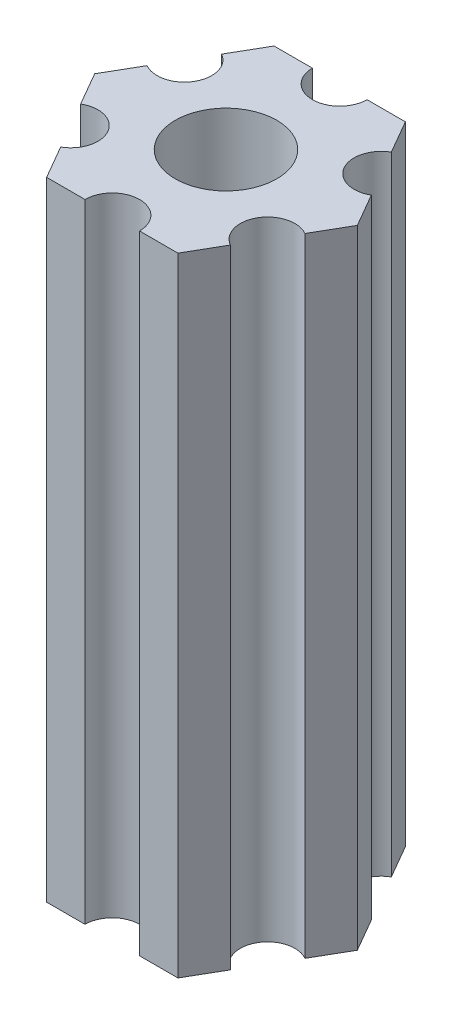
ISO-10303-21;
HEADER;
FILE_DESCRIPTION(('STEP AP214'),'2;1');
FILE_NAME('part.step','',(''),(''),'','','');
FILE_SCHEMA(('AUTOMOTIVE_DESIGN { 1 0 10303 214 1 1 1 1 }'));
ENDSEC;
DATA;
#1=APPLICATION_CONTEXT('core data for automotive mechanical design processes');
#2=APPLICATION_PROTOCOL_DEFINITION('international standard','automotive_design',2000,#1);
#3=PRODUCT_CONTEXT('',#1,'mechanical');
#4=PRODUCT('Part','Part','',(#3));
#5=PRODUCT_RELATED_PRODUCT_CATEGORY('part','',(#4));
#6=PRODUCT_DEFINITION_FORMATION('','',#4);
#7=PRODUCT_DEFINITION_CONTEXT('part definition',#1,'design');
#8=PRODUCT_DEFINITION('design','',#6,#7);
#9=PRODUCT_DEFINITION_SHAPE('','',#8);
#10=(LENGTH_UNIT() NAMED_UNIT(*) SI_UNIT(.MILLI.,.METRE.));
#11=(NAMED_UNIT(*) PLANE_ANGLE_UNIT() SI_UNIT($,.RADIAN.));
#12=(NAMED_UNIT(*) SI_UNIT($,.STERADIAN.) SOLID_ANGLE_UNIT());
#13=UNCERTAINTY_MEASURE_WITH_UNIT(LENGTH_MEASURE(1.E-05),#10,'distance_accuracy_value','');
#14=(GEOMETRIC_REPRESENTATION_CONTEXT(3) GLOBAL_UNCERTAINTY_ASSIGNED_CONTEXT((#13)) GLOBAL_UNIT_ASSIGNED_CONTEXT((#10,
#11,#12)) REPRESENTATION_CONTEXT('',''));
#15=CARTESIAN_POINT('',(0.,0.,0.));
#16=DIRECTION('',(0.,0.,1.));
#17=DIRECTION('',(1.,0.,0.));
#18=AXIS2_PLACEMENT_3D('',#15,#16,#17);
#19=CARTESIAN_POINT('',(77.5897685692615,-34.5,18.0870190528384));
#20=DIRECTION('',(-0.866025403784439,0.,0.5));
#21=DIRECTION('',(0.5,0.,0.866025403784439));
#22=AXIS2_PLACEMENT_3D('',#19,#20,#21);
#23=PLANE('',#22);
#24=DIRECTION('',(0.5,0.,0.866025403784439));
#25=VECTOR('',#24,1.);
#26=CARTESIAN_POINT('',(77.5897685692615,0.,18.0870190528384));
#27=LINE('',#26,#25);
#28=CARTESIAN_POINT('',(77.0626587736528,0.,17.1740381056767));
#29=VERTEX_POINT('',#28);
#30=CARTESIAN_POINT('',(78.1168783648703,0.,19.));
#31=VERTEX_POINT('',#30);
#32=EDGE_CURVE('E11',#29,#31,#27,.T.);
#33=ORIENTED_EDGE('',*,*,#32,.T.);
#34=DIRECTION('',(0.,1.,0.));
#35=VECTOR('',#34,1.);
#36=CARTESIAN_POINT('',(78.1168783648703,-34.5,19.));
#37=LINE('',#36,#35);
#38=CARTESIAN_POINT('',(78.1168783648703,-34.5,19.));
#39=VERTEX_POINT('',#38);
#40=EDGE_CURVE('E24',#39,#31,#37,.T.);
#41=ORIENTED_EDGE('',*,*,#40,.F.);
#42=DIRECTION('',(0.5,0.,0.866025403784439));
#43=VECTOR('',#42,1.);
#44=CARTESIAN_POINT('',(77.5897685692615,-34.5,18.0870190528384));
#45=LINE('',#44,#43);
#46=CARTESIAN_POINT('',(77.0626587736528,-34.5,17.1740381056767));
#47=VERTEX_POINT('',#46);
#48=EDGE_CURVE('E293',#47,#39,#45,.T.);
#49=ORIENTED_EDGE('',*,*,#48,.F.);
#50=DIRECTION('',(0.,1.,0.));
#51=VECTOR('',#50,1.);
#52=CARTESIAN_POINT('',(77.0626587736528,-34.5,17.1740381056767));
#53=LINE('',#52,#51);
#54=EDGE_CURVE('E153',#47,#29,#53,.T.);
#55=ORIENTED_EDGE('',*,*,#54,.T.);
#56=EDGE_LOOP('',(#33,#41,#49,#55));
#57=FACE_BOUND('',#56,.T.);
#58=ADVANCED_FACE('F17',(#57),#23,.F.);
#59=CARTESIAN_POINT('',(77.5897685692615,-34.5,19.9129809471616));
#60=DIRECTION('',(-0.866025403784439,0.,-0.5));
#61=DIRECTION('',(-0.5,0.,0.866025403784439));
#62=AXIS2_PLACEMENT_3D('',#59,#60,#61);
#63=PLANE('',#62);
#64=DIRECTION('',(-0.5,0.,0.866025403784439));
#65=VECTOR('',#64,1.);
#66=CARTESIAN_POINT('',(77.5897685692615,0.,19.9129809471616));
#67=LINE('',#66,#65);
#68=CARTESIAN_POINT('',(77.0626587736528,0.,20.8259618943233));
#69=VERTEX_POINT('',#68);
#70=EDGE_CURVE('E290',#31,#69,#67,.T.);
#71=ORIENTED_EDGE('',*,*,#70,.T.);
#72=DIRECTION('',(0.,1.,0.));
#73=VECTOR('',#72,1.);
#74=CARTESIAN_POINT('',(77.0626587736528,-34.5,20.8259618943233));
#75=LINE('',#74,#73);
#76=CARTESIAN_POINT('',(77.0626587736528,-34.5,20.8259618943233));
#77=VERTEX_POINT('',#76);
#78=EDGE_CURVE('E287',#77,#69,#75,.T.);
#79=ORIENTED_EDGE('',*,*,#78,.F.);
#80=DIRECTION('',(-0.5,0.,0.866025403784439));
#81=VECTOR('',#80,1.);
#82=CARTESIAN_POINT('',(77.5897685692615,-34.5,19.9129809471616));
#83=LINE('',#82,#81);
#84=EDGE_CURVE('E284',#39,#77,#83,.T.);
#85=ORIENTED_EDGE('',*,*,#84,.F.);
#86=ORIENTED_EDGE('',*,*,#40,.T.);
#87=EDGE_LOOP('',(#71,#79,#85,#86));
#88=FACE_BOUND('',#87,.T.);
#89=ADVANCED_FACE('F296',(#88),#63,.F.);
#90=CARTESIAN_POINT('',(76.3126587736527,-34.5,22.125));
#91=DIRECTION('',(0.,1.,0.));
#92=DIRECTION('',(0.,0.,1.));
#93=AXIS2_PLACEMENT_3D('',#90,#91,#92);
#94=CYLINDRICAL_SURFACE('',#93,1.5);
#95=CARTESIAN_POINT('',(76.3126587736527,0.,22.125));
#96=DIRECTION('',(0.,-1.,0.));
#97=DIRECTION('',(0.,0.,-1.));
#98=AXIS2_PLACEMENT_3D('',#95,#96,#97);
#99=CIRCLE('',#98,1.5);
#100=CARTESIAN_POINT('',(75.5626587736527,0.,23.4240381056767));
#101=VERTEX_POINT('',#100);
#102=EDGE_CURVE('E281',#101,#69,#99,.T.);
#103=ORIENTED_EDGE('',*,*,#102,.F.);
#104=DIRECTION('',(0.,1.,0.));
#105=VECTOR('',#104,1.);
#106=CARTESIAN_POINT('',(75.5626587736527,-34.5,23.4240381056767));
#107=LINE('',#106,#105);
#108=CARTESIAN_POINT('',(75.5626587736527,-34.5,23.4240381056767));
#109=VERTEX_POINT('',#108);
#110=EDGE_CURVE('E278',#109,#101,#107,.T.);
#111=ORIENTED_EDGE('',*,*,#110,.F.);
#112=CARTESIAN_POINT('',(76.3126587736527,-34.5,22.125));
#113=DIRECTION('',(0.,-1.,0.));
#114=DIRECTION('',(0.,0.,-1.));
#115=AXIS2_PLACEMENT_3D('',#112,#113,#114);
#116=CIRCLE('',#115,1.5);
#117=EDGE_CURVE('E275',#109,#77,#116,.T.);
#118=ORIENTED_EDGE('',*,*,#117,.T.);
#119=ORIENTED_EDGE('',*,*,#78,.T.);
#120=EDGE_LOOP('',(#103,#111,#118,#119));
#121=FACE_BOUND('',#120,.T.);
#122=ADVANCED_FACE('F302',(#121),#94,.F.);
#123=CARTESIAN_POINT('',(75.035548978044,-34.5,24.3370190528384));
#124=DIRECTION('',(-0.866025403784439,0.,-0.5));
#125=DIRECTION('',(-0.5,0.,0.866025403784439));
#126=AXIS2_PLACEMENT_3D('',#123,#124,#125);
#127=PLANE('',#126);
#128=DIRECTION('',(-0.5,0.,0.866025403784439));
#129=VECTOR('',#128,1.);
#130=CARTESIAN_POINT('',(75.035548978044,0.,24.3370190528384));
#131=LINE('',#130,#129);
#132=CARTESIAN_POINT('',(74.5084391824352,0.,25.25));
#133=VERTEX_POINT('',#132);
#134=EDGE_CURVE('E273',#101,#133,#131,.T.);
#135=ORIENTED_EDGE('',*,*,#134,.T.);
#136=DIRECTION('',(0.,1.,0.));
#137=VECTOR('',#136,1.);
#138=CARTESIAN_POINT('',(74.5084391824352,-34.5,25.25));
#139=LINE('',#138,#137);
#140=CARTESIAN_POINT('',(74.5084391824352,-34.5,25.25));
#141=VERTEX_POINT('',#140);
#142=EDGE_CURVE('E270',#141,#133,#139,.T.);
#143=ORIENTED_EDGE('',*,*,#142,.F.);
#144=DIRECTION('',(-0.5,0.,0.866025403784439));
#145=VECTOR('',#144,1.);
#146=CARTESIAN_POINT('',(75.035548978044,-34.5,24.3370190528384));
#147=LINE('',#146,#145);
#148=EDGE_CURVE('E267',#109,#141,#147,.T.);
#149=ORIENTED_EDGE('',*,*,#148,.F.);
#150=ORIENTED_EDGE('',*,*,#110,.T.);
#151=EDGE_LOOP('',(#135,#143,#149,#150));
#152=FACE_BOUND('',#151,.T.);
#153=ADVANCED_FACE('F305',(#152),#127,.F.);
#154=CARTESIAN_POINT('',(73.4542195912176,-34.5,25.25));
#155=DIRECTION('',(0.,0.,-1.));
#156=DIRECTION('',(-1.,0.,0.));
#157=AXIS2_PLACEMENT_3D('',#154,#155,#156);
#158=PLANE('',#157);
#159=DIRECTION('',(-1.,0.,0.));
#160=VECTOR('',#159,1.);
#161=CARTESIAN_POINT('',(73.4542195912176,0.,25.25));
#162=LINE('',#161,#160);
#163=CARTESIAN_POINT('',(72.4,0.,25.25));
#164=VERTEX_POINT('',#163);
#165=EDGE_CURVE('E265',#133,#164,#162,.T.);
#166=ORIENTED_EDGE('',*,*,#165,.T.);
#167=DIRECTION('',(0.,1.,0.));
#168=VECTOR('',#167,1.);
#169=CARTESIAN_POINT('',(72.4,-34.5,25.25));
#170=LINE('',#169,#168);
#171=CARTESIAN_POINT('',(72.4,-34.5,25.25));
#172=VERTEX_POINT('',#171);
#173=EDGE_CURVE('E262',#172,#164,#170,.T.);
#174=ORIENTED_EDGE('',*,*,#173,.F.);
#175=DIRECTION('',(-1.,0.,0.));
#176=VECTOR('',#175,1.);
#177=CARTESIAN_POINT('',(73.4542195912176,-34.5,25.25));
#178=LINE('',#177,#176);
#179=EDGE_CURVE('E259',#141,#172,#178,.T.);
#180=ORIENTED_EDGE('',*,*,#179,.F.);
#181=ORIENTED_EDGE('',*,*,#142,.T.);
#182=EDGE_LOOP('',(#166,#174,#180,#181));
#183=FACE_BOUND('',#182,.T.);
#184=ADVANCED_FACE('F337',(#183),#158,.F.);
#185=CARTESIAN_POINT('',(70.9,-34.5,25.25));
#186=DIRECTION('',(0.,1.,0.));
#187=DIRECTION('',(0.,0.,1.));
#188=AXIS2_PLACEMENT_3D('',#185,#186,#187);
#189=CYLINDRICAL_SURFACE('',#188,1.5);
#190=CARTESIAN_POINT('',(70.9,0.,25.25));
#191=DIRECTION('',(0.,-1.,0.));
#192=DIRECTION('',(0.,0.,-1.));
#193=AXIS2_PLACEMENT_3D('',#190,#191,#192);
#194=CIRCLE('',#193,1.5);
#195=CARTESIAN_POINT('',(69.4,0.,25.25));
#196=VERTEX_POINT('',#195);
#197=EDGE_CURVE('E256',#196,#164,#194,.T.);
#198=ORIENTED_EDGE('',*,*,#197,.F.);
#199=DIRECTION('',(0.,1.,0.));
#200=VECTOR('',#199,1.);
#201=CARTESIAN_POINT('',(69.4,-34.5,25.25));
#202=LINE('',#201,#200);
#203=CARTESIAN_POINT('',(69.4,-34.5,25.25));
#204=VERTEX_POINT('',#203);
#205=EDGE_CURVE('E253',#204,#196,#202,.T.);
#206=ORIENTED_EDGE('',*,*,#205,.F.);
#207=CARTESIAN_POINT('',(70.9,-34.5,25.25));
#208=DIRECTION('',(0.,-1.,0.));
#209=DIRECTION('',(0.,0.,-1.));
#210=AXIS2_PLACEMENT_3D('',#207,#208,#209);
#211=CIRCLE('',#210,1.5);
#212=EDGE_CURVE('E250',#204,#172,#211,.T.);
#213=ORIENTED_EDGE('',*,*,#212,.T.);
#214=ORIENTED_EDGE('',*,*,#173,.T.);
#215=EDGE_LOOP('',(#198,#206,#213,#214));
#216=FACE_BOUND('',#215,.T.);
#217=ADVANCED_FACE('F340',(#216),#189,.F.);
#218=CARTESIAN_POINT('',(68.3457804087824,-34.5,25.25));
#219=DIRECTION('',(0.,0.,-1.));
#220=DIRECTION('',(-1.,0.,0.));
#221=AXIS2_PLACEMENT_3D('',#218,#219,#220);
#222=PLANE('',#221);
#223=DIRECTION('',(-1.,0.,0.));
#224=VECTOR('',#223,1.);
#225=CARTESIAN_POINT('',(68.3457804087824,0.,25.25));
#226=LINE('',#225,#224);
#227=CARTESIAN_POINT('',(67.2915608175649,0.,25.25));
#228=VERTEX_POINT('',#227);
#229=EDGE_CURVE('E248',#196,#228,#226,.T.);
#230=ORIENTED_EDGE('',*,*,#229,.T.);
#231=DIRECTION('',(0.,1.,0.));
#232=VECTOR('',#231,1.);
#233=CARTESIAN_POINT('',(67.2915608175649,-34.5,25.25));
#234=LINE('',#233,#232);
#235=CARTESIAN_POINT('',(67.2915608175649,-34.5,25.25));
#236=VERTEX_POINT('',#235);
#237=EDGE_CURVE('E245',#236,#228,#234,.T.);
#238=ORIENTED_EDGE('',*,*,#237,.F.);
#239=DIRECTION('',(-1.,0.,0.));
#240=VECTOR('',#239,1.);
#241=CARTESIAN_POINT('',(68.3457804087824,-34.5,25.25));
#242=LINE('',#241,#240);
#243=EDGE_CURVE('E242',#204,#236,#242,.T.);
#244=ORIENTED_EDGE('',*,*,#243,.F.);
#245=ORIENTED_EDGE('',*,*,#205,.T.);
#246=EDGE_LOOP('',(#230,#238,#244,#245));
#247=FACE_BOUND('',#246,.T.);
#248=ADVANCED_FACE('F344',(#247),#222,.F.);
#249=CARTESIAN_POINT('',(66.7644510219561,-34.5,24.3370190528384));
#250=DIRECTION('',(0.866025403784439,0.,-0.5));
#251=DIRECTION('',(-0.5,0.,-0.866025403784439));
#252=AXIS2_PLACEMENT_3D('',#249,#250,#251);
#253=PLANE('',#252);
#254=DIRECTION('',(-0.5,0.,-0.866025403784439));
#255=VECTOR('',#254,1.);
#256=CARTESIAN_POINT('',(66.7644510219561,0.,24.3370190528384));
#257=LINE('',#256,#255);
#258=CARTESIAN_POINT('',(66.2373412263473,0.,23.4240381056767));
#259=VERTEX_POINT('',#258);
#260=EDGE_CURVE('E240',#228,#259,#257,.T.);
#261=ORIENTED_EDGE('',*,*,#260,.T.);
#262=DIRECTION('',(0.,1.,0.));
#263=VECTOR('',#262,1.);
#264=CARTESIAN_POINT('',(66.2373412263473,-34.5,23.4240381056767));
#265=LINE('',#264,#263);
#266=CARTESIAN_POINT('',(66.2373412263473,-34.5,23.4240381056767));
#267=VERTEX_POINT('',#266);
#268=EDGE_CURVE('E237',#267,#259,#265,.T.);
#269=ORIENTED_EDGE('',*,*,#268,.F.);
#270=DIRECTION('',(-0.5,0.,-0.866025403784439));
#271=VECTOR('',#270,1.);
#272=CARTESIAN_POINT('',(66.7644510219561,-34.5,24.3370190528384));
#273=LINE('',#272,#271);
#274=EDGE_CURVE('E234',#236,#267,#273,.T.);
#275=ORIENTED_EDGE('',*,*,#274,.F.);
#276=ORIENTED_EDGE('',*,*,#237,.T.);
#277=EDGE_LOOP('',(#261,#269,#275,#276));
#278=FACE_BOUND('',#277,.T.);
#279=ADVANCED_FACE('F348',(#278),#253,.F.);
#280=CARTESIAN_POINT('',(65.4873412263473,-34.5,22.125));
#281=DIRECTION('',(0.,1.,0.));
#282=DIRECTION('',(0.,0.,1.));
#283=AXIS2_PLACEMENT_3D('',#280,#281,#282);
#284=CYLINDRICAL_SURFACE('',#283,1.5);
#285=CARTESIAN_POINT('',(65.4873412263473,0.,22.125));
#286=DIRECTION('',(0.,-1.,0.));
#287=DIRECTION('',(0.,0.,-1.));
#288=AXIS2_PLACEMENT_3D('',#285,#286,#287);
#289=CIRCLE('',#288,1.5);
#290=CARTESIAN_POINT('',(64.7373412263473,0.,20.8259618943233));
#291=VERTEX_POINT('',#290);
#292=EDGE_CURVE('E231',#291,#259,#289,.T.);
#293=ORIENTED_EDGE('',*,*,#292,.F.);
#294=DIRECTION('',(0.,1.,0.));
#295=VECTOR('',#294,1.);
#296=CARTESIAN_POINT('',(64.7373412263473,-34.5,20.8259618943233));
#297=LINE('',#296,#295);
#298=CARTESIAN_POINT('',(64.7373412263473,-34.5,20.8259618943233));
#299=VERTEX_POINT('',#298);
#300=EDGE_CURVE('E228',#299,#291,#297,.T.);
#301=ORIENTED_EDGE('',*,*,#300,.F.);
#302=CARTESIAN_POINT('',(65.4873412263473,-34.5,22.125));
#303=DIRECTION('',(0.,-1.,0.));
#304=DIRECTION('',(0.,0.,-1.));
#305=AXIS2_PLACEMENT_3D('',#302,#303,#304);
#306=CIRCLE('',#305,1.5);
#307=EDGE_CURVE('E225',#299,#267,#306,.T.);
#308=ORIENTED_EDGE('',*,*,#307,.T.);
#309=ORIENTED_EDGE('',*,*,#268,.T.);
#310=EDGE_LOOP('',(#293,#301,#308,#309));
#311=FACE_BOUND('',#310,.T.);
#312=ADVANCED_FACE('F352',(#311),#284,.F.);
#313=CARTESIAN_POINT('',(64.2102314307385,-34.5,19.9129809471616));
#314=DIRECTION('',(0.866025403784439,0.,-0.5));
#315=DIRECTION('',(-0.5,0.,-0.866025403784439));
#316=AXIS2_PLACEMENT_3D('',#313,#314,#315);
#317=PLANE('',#316);
#318=DIRECTION('',(-0.5,0.,-0.866025403784439));
#319=VECTOR('',#318,1.);
#320=CARTESIAN_POINT('',(64.2102314307385,0.,19.9129809471616));
#321=LINE('',#320,#319);
#322=CARTESIAN_POINT('',(63.6831216351297,0.,19.));
#323=VERTEX_POINT('',#322);
#324=EDGE_CURVE('E223',#291,#323,#321,.T.);
#325=ORIENTED_EDGE('',*,*,#324,.T.);
#326=DIRECTION('',(0.,1.,0.));
#327=VECTOR('',#326,1.);
#328=CARTESIAN_POINT('',(63.6831216351297,-34.5,19.));
#329=LINE('',#328,#327);
#330=CARTESIAN_POINT('',(63.6831216351297,-34.5,19.));
#331=VERTEX_POINT('',#330);
#332=EDGE_CURVE('E220',#331,#323,#329,.T.);
#333=ORIENTED_EDGE('',*,*,#332,.F.);
#334=DIRECTION('',(-0.5,0.,-0.866025403784439));
#335=VECTOR('',#334,1.);
#336=CARTESIAN_POINT('',(64.2102314307385,-34.5,19.9129809471616));
#337=LINE('',#336,#335);
#338=EDGE_CURVE('E217',#299,#331,#337,.T.);
#339=ORIENTED_EDGE('',*,*,#338,.F.);
#340=ORIENTED_EDGE('',*,*,#300,.T.);
#341=EDGE_LOOP('',(#325,#333,#339,#340));
#342=FACE_BOUND('',#341,.T.);
#343=ADVANCED_FACE('F356',(#342),#317,.F.);
#344=CARTESIAN_POINT('',(64.2102314307385,-34.5,18.0870190528384));
#345=DIRECTION('',(0.866025403784439,0.,0.5));
#346=DIRECTION('',(0.5,0.,-0.866025403784439));
#347=AXIS2_PLACEMENT_3D('',#344,#345,#346);
#348=PLANE('',#347);
#349=DIRECTION('',(0.5,0.,-0.866025403784439));
#350=VECTOR('',#349,1.);
#351=CARTESIAN_POINT('',(64.2102314307385,0.,18.0870190528384));
#352=LINE('',#351,#350);
#353=CARTESIAN_POINT('',(64.7373412263473,0.,17.1740381056767));
#354=VERTEX_POINT('',#353);
#355=EDGE_CURVE('E215',#323,#354,#352,.T.);
#356=ORIENTED_EDGE('',*,*,#355,.T.);
#357=DIRECTION('',(0.,1.,0.));
#358=VECTOR('',#357,1.);
#359=CARTESIAN_POINT('',(64.7373412263473,-34.5,17.1740381056767));
#360=LINE('',#359,#358);
#361=CARTESIAN_POINT('',(64.7373412263473,-34.5,17.1740381056767));
#362=VERTEX_POINT('',#361);
#363=EDGE_CURVE('E212',#362,#354,#360,.T.);
#364=ORIENTED_EDGE('',*,*,#363,.F.);
#365=DIRECTION('',(0.5,0.,-0.866025403784439));
#366=VECTOR('',#365,1.);
#367=CARTESIAN_POINT('',(64.2102314307385,-34.5,18.0870190528384));
#368=LINE('',#367,#366);
#369=EDGE_CURVE('E209',#331,#362,#368,.T.);
#370=ORIENTED_EDGE('',*,*,#369,.F.);
#371=ORIENTED_EDGE('',*,*,#332,.T.);
#372=EDGE_LOOP('',(#356,#364,#370,#371));
#373=FACE_BOUND('',#372,.T.);
#374=ADVANCED_FACE('F360',(#373),#348,.F.);
#375=CARTESIAN_POINT('',(65.4873412263473,-34.5,15.875));
#376=DIRECTION('',(0.,1.,0.));
#377=DIRECTION('',(0.,0.,1.));
#378=AXIS2_PLACEMENT_3D('',#375,#376,#377);
#379=CYLINDRICAL_SURFACE('',#378,1.5);
#380=CARTESIAN_POINT('',(65.4873412263473,0.,15.875));
#381=DIRECTION('',(0.,-1.,0.));
#382=DIRECTION('',(0.,0.,-1.));
#383=AXIS2_PLACEMENT_3D('',#380,#381,#382);
#384=CIRCLE('',#383,1.5);
#385=CARTESIAN_POINT('',(66.2373412263473,0.,14.5759618943233));
#386=VERTEX_POINT('',#385);
#387=EDGE_CURVE('E206',#386,#354,#384,.T.);
#388=ORIENTED_EDGE('',*,*,#387,.F.);
#389=DIRECTION('',(0.,1.,0.));
#390=VECTOR('',#389,1.);
#391=CARTESIAN_POINT('',(66.2373412263473,-34.5,14.5759618943233));
#392=LINE('',#391,#390);
#393=CARTESIAN_POINT('',(66.2373412263473,-34.5,14.5759618943233));
#394=VERTEX_POINT('',#393);
#395=EDGE_CURVE('E203',#394,#386,#392,.T.);
#396=ORIENTED_EDGE('',*,*,#395,.F.);
#397=CARTESIAN_POINT('',(65.4873412263473,-34.5,15.875));
#398=DIRECTION('',(0.,-1.,0.));
#399=DIRECTION('',(0.,0.,-1.));
#400=AXIS2_PLACEMENT_3D('',#397,#398,#399);
#401=CIRCLE('',#400,1.5);
#402=EDGE_CURVE('E200',#394,#362,#401,.T.);
#403=ORIENTED_EDGE('',*,*,#402,.T.);
#404=ORIENTED_EDGE('',*,*,#363,.T.);
#405=EDGE_LOOP('',(#388,#396,#403,#404));
#406=FACE_BOUND('',#405,.T.);
#407=ADVANCED_FACE('F364',(#406),#379,.F.);
#408=CARTESIAN_POINT('',(66.7644510219561,-34.5,13.6629809471617));
#409=DIRECTION('',(0.866025403784439,0.,0.5));
#410=DIRECTION('',(0.5,0.,-0.866025403784439));
#411=AXIS2_PLACEMENT_3D('',#408,#409,#410);
#412=PLANE('',#411);
#413=DIRECTION('',(0.5,0.,-0.866025403784439));
#414=VECTOR('',#413,1.);
#415=CARTESIAN_POINT('',(66.7644510219561,0.,13.6629809471617));
#416=LINE('',#415,#414);
#417=CARTESIAN_POINT('',(67.2915608175649,0.,12.75));
#418=VERTEX_POINT('',#417);
#419=EDGE_CURVE('E198',#386,#418,#416,.T.);
#420=ORIENTED_EDGE('',*,*,#419,.T.);
#421=DIRECTION('',(0.,1.,0.));
#422=VECTOR('',#421,1.);
#423=CARTESIAN_POINT('',(67.2915608175649,-34.5,12.75));
#424=LINE('',#423,#422);
#425=CARTESIAN_POINT('',(67.2915608175649,-34.5,12.75));
#426=VERTEX_POINT('',#425);
#427=EDGE_CURVE('E195',#426,#418,#424,.T.);
#428=ORIENTED_EDGE('',*,*,#427,.F.);
#429=DIRECTION('',(0.5,0.,-0.866025403784439));
#430=VECTOR('',#429,1.);
#431=CARTESIAN_POINT('',(66.7644510219561,-34.5,13.6629809471617));
#432=LINE('',#431,#430);
#433=EDGE_CURVE('E192',#394,#426,#432,.T.);
#434=ORIENTED_EDGE('',*,*,#433,.F.);
#435=ORIENTED_EDGE('',*,*,#395,.T.);
#436=EDGE_LOOP('',(#420,#428,#434,#435));
#437=FACE_BOUND('',#436,.T.);
#438=ADVANCED_FACE('F368',(#437),#412,.F.);
#439=CARTESIAN_POINT('',(68.3457804087824,-34.5,12.75));
#440=DIRECTION('',(0.,0.,1.));
#441=DIRECTION('',(1.,0.,0.));
#442=AXIS2_PLACEMENT_3D('',#439,#440,#441);
#443=PLANE('',#442);
#444=DIRECTION('',(1.,0.,0.));
#445=VECTOR('',#444,1.);
#446=CARTESIAN_POINT('',(68.3457804087824,0.,12.75));
#447=LINE('',#446,#445);
#448=CARTESIAN_POINT('',(69.4,0.,12.75));
#449=VERTEX_POINT('',#448);
#450=EDGE_CURVE('E190',#418,#449,#447,.T.);
#451=ORIENTED_EDGE('',*,*,#450,.T.);
#452=DIRECTION('',(0.,1.,0.));
#453=VECTOR('',#452,1.);
#454=CARTESIAN_POINT('',(69.4,-34.5,12.75));
#455=LINE('',#454,#453);
#456=CARTESIAN_POINT('',(69.4,-34.5,12.75));
#457=VERTEX_POINT('',#456);
#458=EDGE_CURVE('E187',#457,#449,#455,.T.);
#459=ORIENTED_EDGE('',*,*,#458,.F.);
#460=DIRECTION('',(1.,0.,0.));
#461=VECTOR('',#460,1.);
#462=CARTESIAN_POINT('',(68.3457804087824,-34.5,12.75));
#463=LINE('',#462,#461);
#464=EDGE_CURVE('E184',#426,#457,#463,.T.);
#465=ORIENTED_EDGE('',*,*,#464,.F.);
#466=ORIENTED_EDGE('',*,*,#427,.T.);
#467=EDGE_LOOP('',(#451,#459,#465,#466));
#468=FACE_BOUND('',#467,.T.);
#469=ADVANCED_FACE('F372',(#468),#443,.F.);
#470=CARTESIAN_POINT('',(70.9,-34.5,12.75));
#471=DIRECTION('',(0.,1.,0.));
#472=DIRECTION('',(0.,0.,1.));
#473=AXIS2_PLACEMENT_3D('',#470,#471,#472);
#474=CYLINDRICAL_SURFACE('',#473,1.5);
#475=CARTESIAN_POINT('',(70.9,0.,12.75));
#476=DIRECTION('',(0.,-1.,0.));
#477=DIRECTION('',(0.,0.,-1.));
#478=AXIS2_PLACEMENT_3D('',#475,#476,#477);
#479=CIRCLE('',#478,1.5);
#480=CARTESIAN_POINT('',(72.4,0.,12.75));
#481=VERTEX_POINT('',#480);
#482=EDGE_CURVE('E181',#481,#449,#479,.T.);
#483=ORIENTED_EDGE('',*,*,#482,.F.);
#484=DIRECTION('',(0.,1.,0.));
#485=VECTOR('',#484,1.);
#486=CARTESIAN_POINT('',(72.4,-34.5,12.75));
#487=LINE('',#486,#485);
#488=CARTESIAN_POINT('',(72.4,-34.5,12.75));
#489=VERTEX_POINT('',#488);
#490=EDGE_CURVE('E178',#489,#481,#487,.T.);
#491=ORIENTED_EDGE('',*,*,#490,.F.);
#492=CARTESIAN_POINT('',(70.9,-34.5,12.75));
#493=DIRECTION('',(0.,-1.,0.));
#494=DIRECTION('',(0.,0.,-1.));
#495=AXIS2_PLACEMENT_3D('',#492,#493,#494);
#496=CIRCLE('',#495,1.5);
#497=EDGE_CURVE('E175',#489,#457,#496,.T.);
#498=ORIENTED_EDGE('',*,*,#497,.T.);
#499=ORIENTED_EDGE('',*,*,#458,.T.);
#500=EDGE_LOOP('',(#483,#491,#498,#499));
#501=FACE_BOUND('',#500,.T.);
#502=ADVANCED_FACE('F376',(#501),#474,.F.);
#503=CARTESIAN_POINT('',(73.4542195912176,-34.5,12.75));
#504=DIRECTION('',(0.,0.,1.));
#505=DIRECTION('',(1.,0.,0.));
#506=AXIS2_PLACEMENT_3D('',#503,#504,#505);
#507=PLANE('',#506);
#508=DIRECTION('',(1.,0.,0.));
#509=VECTOR('',#508,1.);
#510=CARTESIAN_POINT('',(73.4542195912176,0.,12.75));
#511=LINE('',#510,#509);
#512=CARTESIAN_POINT('',(74.5084391824352,0.,12.75));
#513=VERTEX_POINT('',#512);
#514=EDGE_CURVE('E173',#481,#513,#511,.T.);
#515=ORIENTED_EDGE('',*,*,#514,.T.);
#516=DIRECTION('',(0.,1.,0.));
#517=VECTOR('',#516,1.);
#518=CARTESIAN_POINT('',(74.5084391824352,-34.5,12.75));
#519=LINE('',#518,#517);
#520=CARTESIAN_POINT('',(74.5084391824352,-34.5,12.75));
#521=VERTEX_POINT('',#520);
#522=EDGE_CURVE('E171',#521,#513,#519,.T.);
#523=ORIENTED_EDGE('',*,*,#522,.F.);
#524=DIRECTION('',(1.,0.,0.));
#525=VECTOR('',#524,1.);
#526=CARTESIAN_POINT('',(73.4542195912176,-34.5,12.75));
#527=LINE('',#526,#525);
#528=EDGE_CURVE('E161',#489,#521,#527,.T.);
#529=ORIENTED_EDGE('',*,*,#528,.F.);
#530=ORIENTED_EDGE('',*,*,#490,.T.);
#531=EDGE_LOOP('',(#515,#523,#529,#530));
#532=FACE_BOUND('',#531,.T.);
#533=ADVANCED_FACE('F323',(#532),#507,.F.);
#534=CARTESIAN_POINT('',(75.035548978044,-34.5,13.6629809471617));
#535=DIRECTION('',(-0.866025403784439,0.,0.5));
#536=DIRECTION('',(0.5,0.,0.866025403784439));
#537=AXIS2_PLACEMENT_3D('',#534,#535,#536);
#538=PLANE('',#537);
#539=DIRECTION('',(0.5,0.,0.866025403784439));
#540=VECTOR('',#539,1.);
#541=CARTESIAN_POINT('',(75.035548978044,0.,13.6629809471617));
#542=LINE('',#541,#540);
#543=CARTESIAN_POINT('',(75.5626587736527,0.,14.5759618943233));
#544=VERTEX_POINT('',#543);
#545=EDGE_CURVE('E144',#513,#544,#542,.T.);
#546=ORIENTED_EDGE('',*,*,#545,.T.);
#547=DIRECTION('',(0.,1.,0.));
#548=VECTOR('',#547,1.);
#549=CARTESIAN_POINT('',(75.5626587736527,-34.5,14.5759618943233));
#550=LINE('',#549,#548);
#551=CARTESIAN_POINT('',(75.5626587736527,-34.5,14.5759618943233));
#552=VERTEX_POINT('',#551);
#553=EDGE_CURVE('E136',#552,#544,#550,.T.);
#554=ORIENTED_EDGE('',*,*,#553,.F.);
#555=DIRECTION('',(0.5,0.,0.866025403784439));
#556=VECTOR('',#555,1.);
#557=CARTESIAN_POINT('',(75.035548978044,-34.5,13.6629809471617));
#558=LINE('',#557,#556);
#559=EDGE_CURVE('E141',#521,#552,#558,.T.);
#560=ORIENTED_EDGE('',*,*,#559,.F.);
#561=ORIENTED_EDGE('',*,*,#522,.T.);
#562=EDGE_LOOP('',(#546,#554,#560,#561));
#563=FACE_BOUND('',#562,.T.);
#564=ADVANCED_FACE('F138',(#563),#538,.F.);
#565=CARTESIAN_POINT('',(70.9,-34.5,19.));
#566=DIRECTION('',(0.,1.,0.));
#567=DIRECTION('',(0.,0.,1.));
#568=AXIS2_PLACEMENT_3D('',#565,#566,#567);
#569=CYLINDRICAL_SURFACE('',#568,2.79);
#570=CARTESIAN_POINT('',(70.9,-34.5,19.));
#571=DIRECTION('',(0.,-1.,0.));
#572=DIRECTION('',(0.,0.,-1.));
#573=AXIS2_PLACEMENT_3D('',#570,#571,#572);
#574=CIRCLE('',#573,2.79);
#575=CARTESIAN_POINT('',(70.9,-34.5,16.21));
#576=VERTEX_POINT('',#575);
#577=EDGE_CURVE('E162',#576,#576,#574,.T.);
#578=ORIENTED_EDGE('',*,*,#577,.T.);
#579=EDGE_LOOP('',(#578));
#580=FACE_BOUND('',#579,.T.);
#581=CARTESIAN_POINT('',(70.9,0.,19.));
#582=DIRECTION('',(0.,-1.,0.));
#583=DIRECTION('',(0.,0.,-1.));
#584=AXIS2_PLACEMENT_3D('',#581,#582,#583);
#585=CIRCLE('',#584,2.79);
#586=CARTESIAN_POINT('',(70.9,0.,16.21));
#587=VERTEX_POINT('',#586);
#588=EDGE_CURVE('E165',#587,#587,#585,.T.);
#589=ORIENTED_EDGE('',*,*,#588,.F.);
#590=EDGE_LOOP('',(#589));
#591=FACE_BOUND('',#590,.T.);
#592=ADVANCED_FACE('F313',(#580,#591),#569,.F.);
#593=CARTESIAN_POINT('',(76.3126587736527,-34.5,15.875));
#594=DIRECTION('',(0.,1.,0.));
#595=DIRECTION('',(0.,0.,1.));
#596=AXIS2_PLACEMENT_3D('',#593,#594,#595);
#597=CYLINDRICAL_SURFACE('',#596,1.5);
#598=CARTESIAN_POINT('',(76.3126587736527,0.,15.875));
#599=DIRECTION('',(0.,-1.,0.));
#600=DIRECTION('',(0.,0.,-1.));
#601=AXIS2_PLACEMENT_3D('',#598,#599,#600);
#602=CIRCLE('',#601,1.5);
#603=EDGE_CURVE('E156',#29,#544,#602,.T.);
#604=ORIENTED_EDGE('',*,*,#603,.F.);
#605=ORIENTED_EDGE('',*,*,#54,.F.);
#606=CARTESIAN_POINT('',(76.3126587736527,-34.5,15.875));
#607=DIRECTION('',(0.,-1.,0.));
#608=DIRECTION('',(0.,0.,-1.));
#609=AXIS2_PLACEMENT_3D('',#606,#607,#608);
#610=CIRCLE('',#609,1.5);
#611=EDGE_CURVE('E151',#47,#552,#610,.T.);
#612=ORIENTED_EDGE('',*,*,#611,.T.);
#613=ORIENTED_EDGE('',*,*,#553,.T.);
#614=EDGE_LOOP('',(#604,#605,#612,#613));
#615=FACE_BOUND('',#614,.T.);
#616=ADVANCED_FACE('F152',(#615),#597,.F.);
#617=CARTESIAN_POINT('',(70.9,-34.5,12.75));
#618=DIRECTION('',(0.,-1.,0.));
#619=DIRECTION('',(1.,0.,0.));
#620=AXIS2_PLACEMENT_3D('',#617,#618,#619);
#621=PLANE('',#620);
#622=ORIENTED_EDGE('',*,*,#577,.F.);
#623=EDGE_LOOP('',(#622));
#624=FACE_BOUND('',#623,.T.);
#625=ORIENTED_EDGE('',*,*,#48,.T.);
#626=ORIENTED_EDGE('',*,*,#84,.T.);
#627=ORIENTED_EDGE('',*,*,#117,.F.);
#628=ORIENTED_EDGE('',*,*,#148,.T.);
#629=ORIENTED_EDGE('',*,*,#179,.T.);
#630=ORIENTED_EDGE('',*,*,#212,.F.);
#631=ORIENTED_EDGE('',*,*,#243,.T.);
#632=ORIENTED_EDGE('',*,*,#274,.T.);
#633=ORIENTED_EDGE('',*,*,#307,.F.);
#634=ORIENTED_EDGE('',*,*,#338,.T.);
#635=ORIENTED_EDGE('',*,*,#369,.T.);
#636=ORIENTED_EDGE('',*,*,#402,.F.);
#637=ORIENTED_EDGE('',*,*,#433,.T.);
#638=ORIENTED_EDGE('',*,*,#464,.T.);
#639=ORIENTED_EDGE('',*,*,#497,.F.);
#640=ORIENTED_EDGE('',*,*,#528,.T.);
#641=ORIENTED_EDGE('',*,*,#559,.T.);
#642=ORIENTED_EDGE('',*,*,#611,.F.);
#643=EDGE_LOOP('',(#625,#626,#627,#628,#629,#630,#631,#632,#633,#634,#635,#636,#637,#638,#639,
#640,#641,#642));
#644=FACE_BOUND('',#643,.T.);
#645=ADVANCED_FACE('F158',(#624,#644),#621,.T.);
#646=CARTESIAN_POINT('',(70.9,0.,12.75));
#647=DIRECTION('',(0.,-1.,0.));
#648=DIRECTION('',(1.,0.,0.));
#649=AXIS2_PLACEMENT_3D('',#646,#647,#648);
#650=PLANE('',#649);
#651=ORIENTED_EDGE('',*,*,#588,.T.);
#652=EDGE_LOOP('',(#651));
#653=FACE_BOUND('',#652,.T.);
#654=ORIENTED_EDGE('',*,*,#32,.F.);
#655=ORIENTED_EDGE('',*,*,#603,.T.);
#656=ORIENTED_EDGE('',*,*,#545,.F.);
#657=ORIENTED_EDGE('',*,*,#514,.F.);
#658=ORIENTED_EDGE('',*,*,#482,.T.);
#659=ORIENTED_EDGE('',*,*,#450,.F.);
#660=ORIENTED_EDGE('',*,*,#419,.F.);
#661=ORIENTED_EDGE('',*,*,#387,.T.);
#662=ORIENTED_EDGE('',*,*,#355,.F.);
#663=ORIENTED_EDGE('',*,*,#324,.F.);
#664=ORIENTED_EDGE('',*,*,#292,.T.);
#665=ORIENTED_EDGE('',*,*,#260,.F.);
#666=ORIENTED_EDGE('',*,*,#229,.F.);
#667=ORIENTED_EDGE('',*,*,#197,.T.);
#668=ORIENTED_EDGE('',*,*,#165,.F.);
#669=ORIENTED_EDGE('',*,*,#134,.F.);
#670=ORIENTED_EDGE('',*,*,#102,.T.);
#671=ORIENTED_EDGE('',*,*,#70,.F.);
#672=EDGE_LOOP('',(#654,#655,#656,#657,#658,#659,#660,#661,#662,#663,#664,#665,#666,#667,#668,
#669,#670,#671));
#673=FACE_BOUND('',#672,.T.);
#674=ADVANCED_FACE('F298',(#653,#673),#650,.F.);
#675=CLOSED_SHELL('',(#58,#89,#122,#153,#184,#217,#248,#279,#312,#343,#374,#407,#438,#469,#502,
#533,#564,#592,#616,#645,#674));
#676=MANIFOLD_SOLID_BREP('B1',#675);
#677=ADVANCED_BREP_SHAPE_REPRESENTATION('',(#18,#676),#14);
#678=SHAPE_DEFINITION_REPRESENTATION(#9,#677);
ENDSEC;
END-ISO-10303-21;
